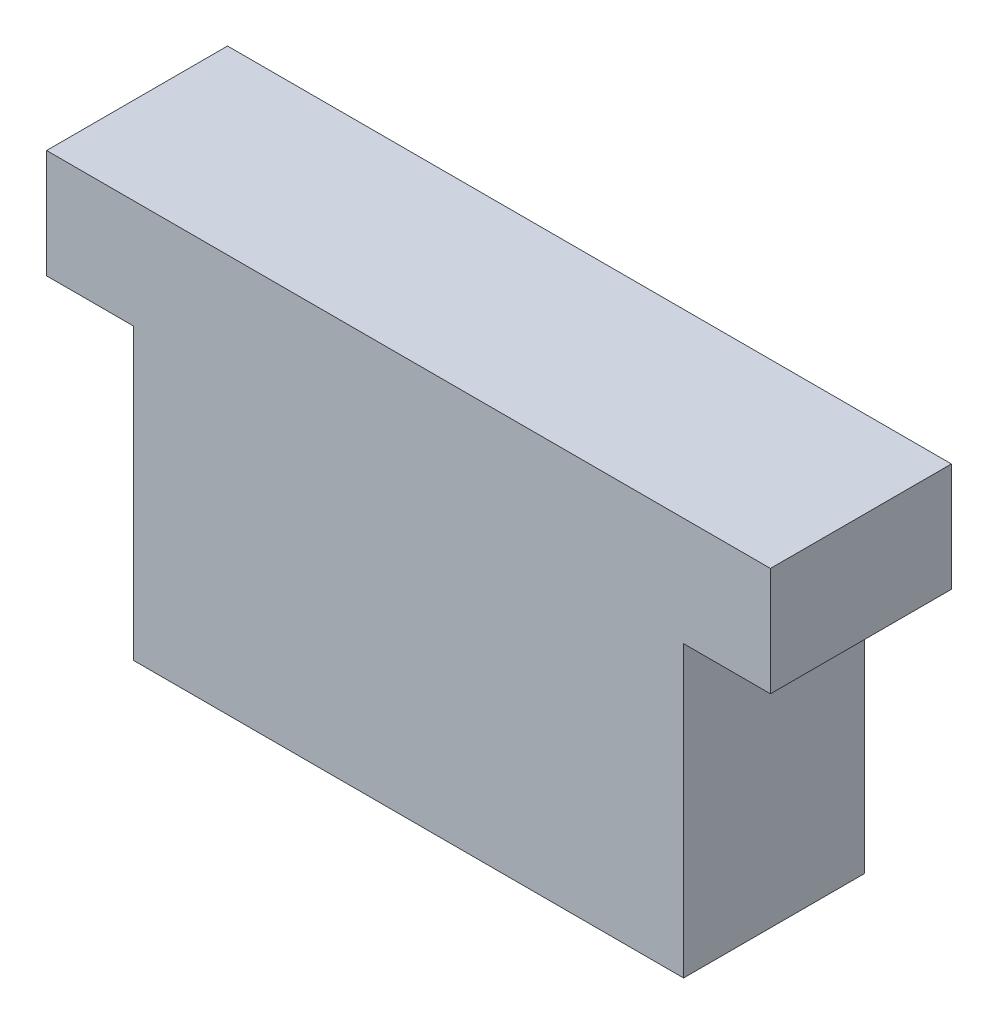
ISO-10303-21;
HEADER;
FILE_DESCRIPTION(('STEP AP214'),'2;1');
FILE_NAME('part.step','',(''),(''),'','','');
FILE_SCHEMA(('AUTOMOTIVE_DESIGN { 1 0 10303 214 1 1 1 1 }'));
ENDSEC;
DATA;
#1=APPLICATION_CONTEXT('core data for automotive mechanical design processes');
#2=APPLICATION_PROTOCOL_DEFINITION('international standard','automotive_design',2000,#1);
#3=PRODUCT_CONTEXT('',#1,'mechanical');
#4=PRODUCT('Part','Part','',(#3));
#5=PRODUCT_RELATED_PRODUCT_CATEGORY('part','',(#4));
#6=PRODUCT_DEFINITION_FORMATION('','',#4);
#7=PRODUCT_DEFINITION_CONTEXT('part definition',#1,'design');
#8=PRODUCT_DEFINITION('design','',#6,#7);
#9=PRODUCT_DEFINITION_SHAPE('','',#8);
#10=(LENGTH_UNIT() NAMED_UNIT(*) SI_UNIT(.MILLI.,.METRE.));
#11=(NAMED_UNIT(*) PLANE_ANGLE_UNIT() SI_UNIT($,.RADIAN.));
#12=(NAMED_UNIT(*) SI_UNIT($,.STERADIAN.) SOLID_ANGLE_UNIT());
#13=UNCERTAINTY_MEASURE_WITH_UNIT(LENGTH_MEASURE(1.E-05),#10,'distance_accuracy_value','');
#14=(GEOMETRIC_REPRESENTATION_CONTEXT(3) GLOBAL_UNCERTAINTY_ASSIGNED_CONTEXT((#13)) GLOBAL_UNIT_ASSIGNED_CONTEXT((#10,
#11,#12)) REPRESENTATION_CONTEXT('',''));
#15=CARTESIAN_POINT('',(0.,0.,0.));
#16=DIRECTION('',(0.,0.,1.));
#17=DIRECTION('',(1.,0.,0.));
#18=AXIS2_PLACEMENT_3D('',#15,#16,#17);
#19=CARTESIAN_POINT('',(0.,-1.5,5.));
#20=DIRECTION('',(0.,1.,0.));
#21=DIRECTION('',(0.,0.,1.));
#22=AXIS2_PLACEMENT_3D('',#19,#20,#21);
#23=PLANE('',#22);
#24=DIRECTION('',(1.,0.,0.));
#25=VECTOR('',#24,1.);
#26=CARTESIAN_POINT('',(0.,-1.5,0.));
#27=LINE('',#26,#25);
#28=CARTESIAN_POINT('',(-10.,-1.5,0.));
#29=VERTEX_POINT('',#28);
#30=CARTESIAN_POINT('',(-7.6,-1.5,0.));
#31=VERTEX_POINT('',#30);
#32=EDGE_CURVE('E135',#29,#31,#27,.T.);
#33=ORIENTED_EDGE('',*,*,#32,.T.);
#34=DIRECTION('',(0.,0.,-1.));
#35=VECTOR('',#34,1.);
#36=CARTESIAN_POINT('',(-7.6,-1.5,5.));
#37=LINE('',#36,#35);
#38=CARTESIAN_POINT('',(-7.6,-1.5,5.));
#39=VERTEX_POINT('',#38);
#40=EDGE_CURVE('E11',#39,#31,#37,.T.);
#41=ORIENTED_EDGE('',*,*,#40,.F.);
#42=DIRECTION('',(1.,0.,0.));
#43=VECTOR('',#42,1.);
#44=CARTESIAN_POINT('',(0.,-1.5,5.));
#45=LINE('',#44,#43);
#46=CARTESIAN_POINT('',(-10.,-1.5,5.));
#47=VERTEX_POINT('',#46);
#48=EDGE_CURVE('E152',#47,#39,#45,.T.);
#49=ORIENTED_EDGE('',*,*,#48,.F.);
#50=DIRECTION('',(0.,0.,-1.));
#51=VECTOR('',#50,1.);
#52=CARTESIAN_POINT('',(-10.,-1.5,5.));
#53=LINE('',#52,#51);
#54=EDGE_CURVE('E53',#47,#29,#53,.T.);
#55=ORIENTED_EDGE('',*,*,#54,.T.);
#56=EDGE_LOOP('',(#33,#41,#49,#55));
#57=FACE_BOUND('',#56,.T.);
#58=ADVANCED_FACE('F36',(#57),#23,.F.);
#59=CARTESIAN_POINT('',(-7.6,0.,5.));
#60=DIRECTION('',(1.,0.,0.));
#61=DIRECTION('',(0.,1.,0.));
#62=AXIS2_PLACEMENT_3D('',#59,#60,#61);
#63=PLANE('',#62);
#64=DIRECTION('',(0.,-1.,0.));
#65=VECTOR('',#64,1.);
#66=CARTESIAN_POINT('',(-7.6,0.,0.));
#67=LINE('',#66,#65);
#68=CARTESIAN_POINT('',(-7.6,-9.5,0.));
#69=VERTEX_POINT('',#68);
#70=EDGE_CURVE('E137',#31,#69,#67,.T.);
#71=ORIENTED_EDGE('',*,*,#70,.T.);
#72=DIRECTION('',(0.,0.,-1.));
#73=VECTOR('',#72,1.);
#74=CARTESIAN_POINT('',(-7.6,-9.5,5.));
#75=LINE('',#74,#73);
#76=CARTESIAN_POINT('',(-7.6,-9.5,5.));
#77=VERTEX_POINT('',#76);
#78=EDGE_CURVE('E45',#77,#69,#75,.T.);
#79=ORIENTED_EDGE('',*,*,#78,.F.);
#80=DIRECTION('',(0.,-1.,0.));
#81=VECTOR('',#80,1.);
#82=CARTESIAN_POINT('',(-7.6,0.,5.));
#83=LINE('',#82,#81);
#84=EDGE_CURVE('E91',#39,#77,#83,.T.);
#85=ORIENTED_EDGE('',*,*,#84,.F.);
#86=ORIENTED_EDGE('',*,*,#40,.T.);
#87=EDGE_LOOP('',(#71,#79,#85,#86));
#88=FACE_BOUND('',#87,.T.);
#89=ADVANCED_FACE('F38',(#88),#63,.F.);
#90=CARTESIAN_POINT('',(0.,-9.5,5.));
#91=DIRECTION('',(0.,1.,0.));
#92=DIRECTION('',(0.,0.,1.));
#93=AXIS2_PLACEMENT_3D('',#90,#91,#92);
#94=PLANE('',#93);
#95=DIRECTION('',(1.,0.,0.));
#96=VECTOR('',#95,1.);
#97=CARTESIAN_POINT('',(0.,-9.5,0.));
#98=LINE('',#97,#96);
#99=CARTESIAN_POINT('',(7.6,-9.5,0.));
#100=VERTEX_POINT('',#99);
#101=EDGE_CURVE('E140',#69,#100,#98,.T.);
#102=ORIENTED_EDGE('',*,*,#101,.T.);
#103=DIRECTION('',(0.,0.,-1.));
#104=VECTOR('',#103,1.);
#105=CARTESIAN_POINT('',(7.6,-9.5,5.));
#106=LINE('',#105,#104);
#107=CARTESIAN_POINT('',(7.6,-9.5,5.));
#108=VERTEX_POINT('',#107);
#109=EDGE_CURVE('E158',#108,#100,#106,.T.);
#110=ORIENTED_EDGE('',*,*,#109,.F.);
#111=DIRECTION('',(1.,0.,0.));
#112=VECTOR('',#111,1.);
#113=CARTESIAN_POINT('',(0.,-9.5,5.));
#114=LINE('',#113,#112);
#115=EDGE_CURVE('E165',#77,#108,#114,.T.);
#116=ORIENTED_EDGE('',*,*,#115,.F.);
#117=ORIENTED_EDGE('',*,*,#78,.T.);
#118=EDGE_LOOP('',(#102,#110,#116,#117));
#119=FACE_BOUND('',#118,.T.);
#120=ADVANCED_FACE('F163',(#119),#94,.F.);
#121=CARTESIAN_POINT('',(7.6,0.,5.));
#122=DIRECTION('',(1.,0.,0.));
#123=DIRECTION('',(0.,0.,-1.));
#124=AXIS2_PLACEMENT_3D('',#121,#122,#123);
#125=PLANE('',#124);
#126=DIRECTION('',(0.,-1.,0.));
#127=VECTOR('',#126,1.);
#128=CARTESIAN_POINT('',(7.6,0.,0.));
#129=LINE('',#128,#127);
#130=CARTESIAN_POINT('',(7.6,-1.5,0.));
#131=VERTEX_POINT('',#130);
#132=EDGE_CURVE('E143',#131,#100,#129,.T.);
#133=ORIENTED_EDGE('',*,*,#132,.F.);
#134=DIRECTION('',(0.,0.,-1.));
#135=VECTOR('',#134,1.);
#136=CARTESIAN_POINT('',(7.6,-1.5,5.));
#137=LINE('',#136,#135);
#138=CARTESIAN_POINT('',(7.6,-1.5,5.));
#139=VERTEX_POINT('',#138);
#140=EDGE_CURVE('E156',#139,#131,#137,.T.);
#141=ORIENTED_EDGE('',*,*,#140,.F.);
#142=DIRECTION('',(0.,-1.,0.));
#143=VECTOR('',#142,1.);
#144=CARTESIAN_POINT('',(7.6,0.,5.));
#145=LINE('',#144,#143);
#146=EDGE_CURVE('E173',#139,#108,#145,.T.);
#147=ORIENTED_EDGE('',*,*,#146,.T.);
#148=ORIENTED_EDGE('',*,*,#109,.T.);
#149=EDGE_LOOP('',(#133,#141,#147,#148));
#150=FACE_BOUND('',#149,.T.);
#151=ADVANCED_FACE('F171',(#150),#125,.T.);
#152=CARTESIAN_POINT('',(9.99999999999999,-1.5,0.));
#153=VERTEX_POINT('',#152);
#154=EDGE_CURVE('E138',#131,#153,#27,.T.);
#155=ORIENTED_EDGE('',*,*,#154,.T.);
#156=DIRECTION('',(0.,0.,-1.));
#157=VECTOR('',#156,1.);
#158=CARTESIAN_POINT('',(9.99999999999999,-1.5,5.));
#159=LINE('',#158,#157);
#160=CARTESIAN_POINT('',(9.99999999999999,-1.5,5.));
#161=VERTEX_POINT('',#160);
#162=EDGE_CURVE('E127',#161,#153,#159,.T.);
#163=ORIENTED_EDGE('',*,*,#162,.F.);
#164=EDGE_CURVE('E115',#139,#161,#45,.T.);
#165=ORIENTED_EDGE('',*,*,#164,.F.);
#166=ORIENTED_EDGE('',*,*,#140,.T.);
#167=EDGE_LOOP('',(#155,#163,#165,#166));
#168=FACE_BOUND('',#167,.T.);
#169=ADVANCED_FACE('F184',(#168),#23,.F.);
#170=CARTESIAN_POINT('',(9.99999999999999,0.,5.));
#171=DIRECTION('',(-1.,0.,0.));
#172=DIRECTION('',(0.,0.,1.));
#173=AXIS2_PLACEMENT_3D('',#170,#171,#172);
#174=PLANE('',#173);
#175=DIRECTION('',(0.,1.,0.));
#176=VECTOR('',#175,1.);
#177=CARTESIAN_POINT('',(9.99999999999999,0.,0.));
#178=LINE('',#177,#176);
#179=CARTESIAN_POINT('',(9.99999999999999,1.5,0.));
#180=VERTEX_POINT('',#179);
#181=EDGE_CURVE('E124',#153,#180,#178,.T.);
#182=ORIENTED_EDGE('',*,*,#181,.T.);
#183=DIRECTION('',(0.,0.,-1.));
#184=VECTOR('',#183,1.);
#185=CARTESIAN_POINT('',(9.99999999999999,1.5,5.));
#186=LINE('',#185,#184);
#187=CARTESIAN_POINT('',(9.99999999999999,1.5,5.));
#188=VERTEX_POINT('',#187);
#189=EDGE_CURVE('E121',#188,#180,#186,.T.);
#190=ORIENTED_EDGE('',*,*,#189,.F.);
#191=DIRECTION('',(0.,1.,0.));
#192=VECTOR('',#191,1.);
#193=CARTESIAN_POINT('',(9.99999999999999,0.,5.));
#194=LINE('',#193,#192);
#195=EDGE_CURVE('E107',#161,#188,#194,.T.);
#196=ORIENTED_EDGE('',*,*,#195,.F.);
#197=ORIENTED_EDGE('',*,*,#162,.T.);
#198=EDGE_LOOP('',(#182,#190,#196,#197));
#199=FACE_BOUND('',#198,.T.);
#200=ADVANCED_FACE('F122',(#199),#174,.F.);
#201=CARTESIAN_POINT('',(0.,1.5,5.));
#202=DIRECTION('',(0.,1.,0.));
#203=DIRECTION('',(0.,0.,1.));
#204=AXIS2_PLACEMENT_3D('',#201,#202,#203);
#205=PLANE('',#204);
#206=DIRECTION('',(1.,0.,0.));
#207=VECTOR('',#206,1.);
#208=CARTESIAN_POINT('',(0.,1.5,0.));
#209=LINE('',#208,#207);
#210=CARTESIAN_POINT('',(-10.,1.5,0.));
#211=VERTEX_POINT('',#210);
#212=EDGE_CURVE('E147',#211,#180,#209,.T.);
#213=ORIENTED_EDGE('',*,*,#212,.F.);
#214=DIRECTION('',(0.,0.,-1.));
#215=VECTOR('',#214,1.);
#216=CARTESIAN_POINT('',(-10.,1.5,5.));
#217=LINE('',#216,#215);
#218=CARTESIAN_POINT('',(-10.,1.5,5.));
#219=VERTEX_POINT('',#218);
#220=EDGE_CURVE('E79',#219,#211,#217,.T.);
#221=ORIENTED_EDGE('',*,*,#220,.F.);
#222=DIRECTION('',(1.,0.,0.));
#223=VECTOR('',#222,1.);
#224=CARTESIAN_POINT('',(0.,1.5,5.));
#225=LINE('',#224,#223);
#226=EDGE_CURVE('E112',#219,#188,#225,.T.);
#227=ORIENTED_EDGE('',*,*,#226,.T.);
#228=ORIENTED_EDGE('',*,*,#189,.T.);
#229=EDGE_LOOP('',(#213,#221,#227,#228));
#230=FACE_BOUND('',#229,.T.);
#231=ADVANCED_FACE('F129',(#230),#205,.T.);
#232=CARTESIAN_POINT('',(-10.,0.,5.));
#233=DIRECTION('',(-1.,0.,0.));
#234=DIRECTION('',(0.,0.,1.));
#235=AXIS2_PLACEMENT_3D('',#232,#233,#234);
#236=PLANE('',#235);
#237=DIRECTION('',(0.,1.,0.));
#238=VECTOR('',#237,1.);
#239=CARTESIAN_POINT('',(-10.,0.,0.));
#240=LINE('',#239,#238);
#241=EDGE_CURVE('E149',#29,#211,#240,.T.);
#242=ORIENTED_EDGE('',*,*,#241,.F.);
#243=ORIENTED_EDGE('',*,*,#54,.F.);
#244=DIRECTION('',(0.,1.,0.));
#245=VECTOR('',#244,1.);
#246=CARTESIAN_POINT('',(-10.,0.,5.));
#247=LINE('',#246,#245);
#248=EDGE_CURVE('E130',#47,#219,#247,.T.);
#249=ORIENTED_EDGE('',*,*,#248,.T.);
#250=ORIENTED_EDGE('',*,*,#220,.T.);
#251=EDGE_LOOP('',(#242,#243,#249,#250));
#252=FACE_BOUND('',#251,.T.);
#253=ADVANCED_FACE('F195',(#252),#236,.T.);
#254=CARTESIAN_POINT('',(0.,0.,5.));
#255=DIRECTION('',(0.,0.,1.));
#256=DIRECTION('',(1.,0.,0.));
#257=AXIS2_PLACEMENT_3D('',#254,#255,#256);
#258=PLANE('',#257);
#259=ORIENTED_EDGE('',*,*,#48,.T.);
#260=ORIENTED_EDGE('',*,*,#84,.T.);
#261=ORIENTED_EDGE('',*,*,#115,.T.);
#262=ORIENTED_EDGE('',*,*,#146,.F.);
#263=ORIENTED_EDGE('',*,*,#164,.T.);
#264=ORIENTED_EDGE('',*,*,#195,.T.);
#265=ORIENTED_EDGE('',*,*,#226,.F.);
#266=ORIENTED_EDGE('',*,*,#248,.F.);
#267=EDGE_LOOP('',(#259,#260,#261,#262,#263,#264,#265,#266));
#268=FACE_BOUND('',#267,.T.);
#269=ADVANCED_FACE('F109',(#268),#258,.T.);
#270=CARTESIAN_POINT('',(0.,0.,0.));
#271=DIRECTION('',(0.,0.,1.));
#272=DIRECTION('',(1.,0.,0.));
#273=AXIS2_PLACEMENT_3D('',#270,#271,#272);
#274=PLANE('',#273);
#275=ORIENTED_EDGE('',*,*,#32,.F.);
#276=ORIENTED_EDGE('',*,*,#241,.T.);
#277=ORIENTED_EDGE('',*,*,#212,.T.);
#278=ORIENTED_EDGE('',*,*,#181,.F.);
#279=ORIENTED_EDGE('',*,*,#154,.F.);
#280=ORIENTED_EDGE('',*,*,#132,.T.);
#281=ORIENTED_EDGE('',*,*,#101,.F.);
#282=ORIENTED_EDGE('',*,*,#70,.F.);
#283=EDGE_LOOP('',(#275,#276,#277,#278,#279,#280,#281,#282));
#284=FACE_BOUND('',#283,.T.);
#285=ADVANCED_FACE('F167',(#284),#274,.F.);
#286=CLOSED_SHELL('',(#58,#89,#120,#151,#169,#200,#231,#253,#269,#285));
#287=MANIFOLD_SOLID_BREP('B2',#286);
#288=ADVANCED_BREP_SHAPE_REPRESENTATION('',(#18,#287),#14);
#289=SHAPE_DEFINITION_REPRESENTATION(#9,#288);
ENDSEC;
END-ISO-10303-21;
